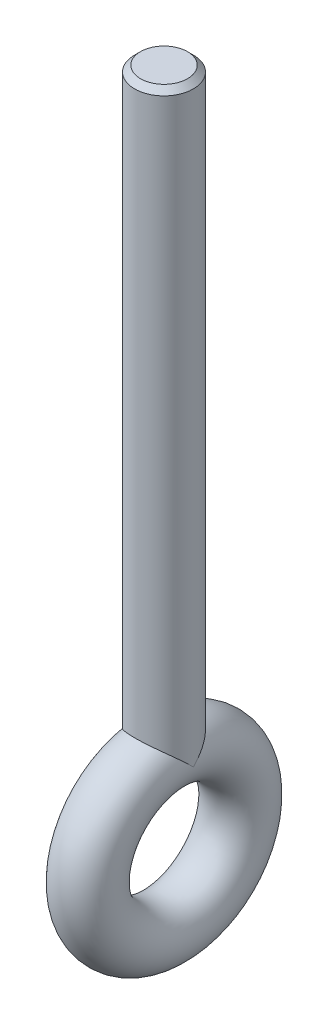
ISO-10303-21;
HEADER;
FILE_DESCRIPTION(('STEP AP214'),'2;1');
FILE_NAME('part.step','',(''),(''),'','','');
FILE_SCHEMA(('AUTOMOTIVE_DESIGN { 1 0 10303 214 1 1 1 1 }'));
ENDSEC;
DATA;
#1=APPLICATION_CONTEXT('core data for automotive mechanical design processes');
#2=APPLICATION_PROTOCOL_DEFINITION('international standard','automotive_design',2000,#1);
#3=PRODUCT_CONTEXT('',#1,'mechanical');
#4=PRODUCT('Part','Part','',(#3));
#5=PRODUCT_RELATED_PRODUCT_CATEGORY('part','',(#4));
#6=PRODUCT_DEFINITION_FORMATION('','',#4);
#7=PRODUCT_DEFINITION_CONTEXT('part definition',#1,'design');
#8=PRODUCT_DEFINITION('design','',#6,#7);
#9=PRODUCT_DEFINITION_SHAPE('','',#8);
#10=(LENGTH_UNIT() NAMED_UNIT(*) SI_UNIT(.MILLI.,.METRE.));
#11=(NAMED_UNIT(*) PLANE_ANGLE_UNIT() SI_UNIT($,.RADIAN.));
#12=(NAMED_UNIT(*) SI_UNIT($,.STERADIAN.) SOLID_ANGLE_UNIT());
#13=UNCERTAINTY_MEASURE_WITH_UNIT(LENGTH_MEASURE(1.E-05),#10,'distance_accuracy_value','');
#14=(GEOMETRIC_REPRESENTATION_CONTEXT(3) GLOBAL_UNCERTAINTY_ASSIGNED_CONTEXT((#13)) GLOBAL_UNIT_ASSIGNED_CONTEXT((#10,
#11,#12)) REPRESENTATION_CONTEXT('',''));
#15=CARTESIAN_POINT('',(0.,0.,0.));
#16=DIRECTION('',(0.,0.,1.));
#17=DIRECTION('',(1.,0.,0.));
#18=AXIS2_PLACEMENT_3D('',#15,#16,#17);
#19=CARTESIAN_POINT('',(0.,-57.,0.));
#20=DIRECTION('',(1.,0.,0.));
#21=DIRECTION('',(0.,0.,1.));
#22=AXIS2_PLACEMENT_3D('',#19,#20,#21);
#23=TOROIDAL_SURFACE('',#22,6.5,2.5);
#24=CARTESIAN_POINT('',(2.5,-50.5,0.));
#25=CARTESIAN_POINT('',(2.4999998519753,-50.4651649450499,0.0348344505927025));
#26=CARTESIAN_POINT('',(2.49927189941043,-50.4304676053622,0.0698082826245213));
#27=CARTESIAN_POINT('',(2.49633216551129,-50.3615765351389,0.139792227453705));
#28=CARTESIAN_POINT('',(2.49412892246899,-50.3273810572834,0.174800980537367));
#29=CARTESIAN_POINT('',(2.48822941530881,-50.2595312191127,0.244796587317843));
#30=CARTESIAN_POINT('',(2.48454243864865,-50.2258748225426,0.279782245642688));
#31=CARTESIAN_POINT('',(2.47566870387325,-50.1591399280342,0.349669598496877));
#32=CARTESIAN_POINT('',(2.47049199876416,-50.1260590825694,0.38457032471366));
#33=CARTESIAN_POINT('',(2.45863483508742,-50.0605110677205,0.454223498115318));
#34=CARTESIAN_POINT('',(2.45196520328561,-50.0280412191219,0.48897526297605));
#35=CARTESIAN_POINT('',(2.43712097010707,-49.9637498764985,0.558263726688542));
#36=CARTESIAN_POINT('',(2.42895797074275,-49.9319253523633,0.592800095229456));
#37=CARTESIAN_POINT('',(2.41112871125689,-49.8689584869557,0.661589292403951));
#38=CARTESIAN_POINT('',(2.40147482070587,-49.837812744329,0.695842208097111));
#39=CARTESIAN_POINT('',(2.38066814398586,-49.7762352340584,0.763993019045374));
#40=CARTESIAN_POINT('',(2.3695284804141,-49.7457996840722,0.797891499132743));
#41=CARTESIAN_POINT('',(2.34503626255162,-49.6838497018394,0.867312180624524));
#42=CARTESIAN_POINT('',(2.33159898290379,-49.6523610258926,0.902827554412133));
#43=CARTESIAN_POINT('',(2.30302708267719,-49.590198054588,0.973385329518649));
#44=CARTESIAN_POINT('',(2.28790563583952,-49.5595194797625,1.00842928926445));
#45=CARTESIAN_POINT('',(2.25597165670608,-49.4990190219382,1.07795984691652));
#46=CARTESIAN_POINT('',(2.23917299705823,-49.4691923704029,1.11244865831707));
#47=CARTESIAN_POINT('',(2.20389555666032,-49.4104387224069,1.18078394377793));
#48=CARTESIAN_POINT('',(2.18543126933451,-49.3815064425272,1.21463334819587));
#49=CARTESIAN_POINT('',(2.14683788839919,-49.3245835551725,1.28160347350608));
#50=CARTESIAN_POINT('',(2.12672381551575,-49.2965871411921,1.3147279046903));
#51=CARTESIAN_POINT('',(2.08485076598944,-49.2415774283213,1.38016096068789));
#52=CARTESIAN_POINT('',(2.06310722314869,-49.21455779598,1.41247412647262));
#53=CARTESIAN_POINT('',(2.01799983536828,-49.1615425293011,1.47619745561844));
#54=CARTESIAN_POINT('',(1.99465170286396,-49.1355400396073,1.50761302420076));
#55=CARTESIAN_POINT('',(1.94636440869489,-49.0845989296952,1.56945289650165));
#56=CARTESIAN_POINT('',(1.92144108489697,-49.059652952365,1.5998834968128));
#57=CARTESIAN_POINT('',(1.86827481321106,-49.0091920995661,1.66172044012806));
#58=CARTESIAN_POINT('',(1.83992261267587,-48.9837314862613,1.69307733209747));
#59=CARTESIAN_POINT('',(1.78149743865257,-48.9341316306051,1.75444632253052));
#60=CARTESIAN_POINT('',(1.75144413676242,-48.9099818533725,1.78446861568752));
#61=CARTESIAN_POINT('',(1.68967262573154,-48.8630476111479,1.84306459913478));
#62=CARTESIAN_POINT('',(1.65797349366026,-48.8402521351544,1.87164955443036));
#63=CARTESIAN_POINT('',(1.59297332072478,-48.7960704029711,1.92727019017921));
#64=CARTESIAN_POINT('',(1.55969045668714,-48.7746727732271,1.95431805353105));
#65=CARTESIAN_POINT('',(1.49159173930169,-48.7333293460177,2.00676708176753));
#66=CARTESIAN_POINT('',(1.45679286813338,-48.7133719724325,2.03218113991001));
#67=CARTESIAN_POINT('',(1.38573871319276,-48.6749512938846,2.08126845902746));
#68=CARTESIAN_POINT('',(1.34949891991776,-48.6564763980875,2.10495505796956));
#69=CARTESIAN_POINT('',(1.2756413013032,-48.6210602148965,2.1505000476379));
#70=CARTESIAN_POINT('',(1.23803725698496,-48.6041075664873,2.17237186936555));
#71=CARTESIAN_POINT('',(1.18056518589665,-48.5798168441105,2.20379997485233));
#72=CARTESIAN_POINT('',(1.16128646235409,-48.5719304635984,2.21401896202217));
#73=CARTESIAN_POINT('',(1.12242007277858,-48.5565545799554,2.23397052295273));
#74=CARTESIAN_POINT('',(1.10283375518018,-48.5490637606325,2.24370470278832));
#75=CARTESIAN_POINT('',(1.06225218019391,-48.5340735063834,2.26321219369764));
#76=CARTESIAN_POINT('',(1.04123722038652,-48.5265946016373,2.27296030480898));
#77=CARTESIAN_POINT('',(0.998921100046556,-48.5121017732341,2.29187752025771));
#78=CARTESIAN_POINT('',(0.977621761813773,-48.505085818838,2.3010491436022));
#79=CARTESIAN_POINT('',(0.934752733102131,-48.4915218190078,2.318803311869));
#80=CARTESIAN_POINT('',(0.913184671359649,-48.4849718268857,2.32738830085755));
#81=CARTESIAN_POINT('',(0.869794416154352,-48.4723426722087,2.3439599832655));
#82=CARTESIAN_POINT('',(0.847973657026655,-48.4662616606127,2.35194902176108));
#83=CARTESIAN_POINT('',(0.804094486610989,-48.4545732562204,2.36732011428389));
#84=CARTESIAN_POINT('',(0.782037317347516,-48.4489641263156,2.37470439165566));
#85=CARTESIAN_POINT('',(0.737702078084783,-48.4382221809127,2.38885790757353));
#86=CARTESIAN_POINT('',(0.715425062374308,-48.4330877543173,2.39562922467928));
#87=CARTESIAN_POINT('',(0.670667132288324,-48.4232978117753,2.40854939010882));
#88=CARTESIAN_POINT('',(0.648187091742627,-48.4186408246102,2.4147001496739));
#89=CARTESIAN_POINT('',(0.603040352050533,-48.4098082632042,2.42637241392847));
#90=CARTESIAN_POINT('',(0.58037435624373,-48.4056313710396,2.43189564077238));
#91=CARTESIAN_POINT('',(0.534873168729661,-48.3977614099155,2.44230670748851));
#92=CARTESIAN_POINT('',(0.512038522509422,-48.3940671890994,2.44719605982719));
#93=CARTESIAN_POINT('',(0.466217704527621,-48.387164891372,2.4563339106165));
#94=CARTESIAN_POINT('',(0.443231935613273,-48.3839558405927,2.46058369277738));
#95=CARTESIAN_POINT('',(0.397126734920186,-48.3780261158144,2.46843761078168));
#96=CARTESIAN_POINT('',(0.374007580983801,-48.3753046568067,2.47204278440668));
#97=CARTESIAN_POINT('',(0.327653649856744,-48.3703522621338,2.47860337611999));
#98=CARTESIAN_POINT('',(0.304419045346194,-48.3681207399483,2.48155957112254));
#99=CARTESIAN_POINT('',(0.257852414064226,-48.3641502797345,2.48681878545556));
#100=CARTESIAN_POINT('',(0.234520476588794,-48.362410961886,2.4891223084362));
#101=CARTESIAN_POINT('',(0.187777526619067,-48.3594268872479,2.49307345851044));
#102=CARTESIAN_POINT('',(0.164366543425,-48.3581819639775,2.49472130639426));
#103=CARTESIAN_POINT('',(0.117483978984563,-48.3561885662396,2.49735907293356));
#104=CARTESIAN_POINT('',(0.0940123916718671,-48.3554401435709,2.49834892294169));
#105=CARTESIAN_POINT('',(0.0470272147667755,-48.3544415642529,2.49966941804037));
#106=CARTESIAN_POINT('',(0.0235136092073164,-48.3541916808299,2.49999970165322));
#107=CARTESIAN_POINT('',(-0.0235098489591216,-48.3541918533658,2.50000029829917));
#108=CARTESIAN_POINT('',(-0.0470197015649339,-48.3544418293819,2.49967071686498));
#109=CARTESIAN_POINT('',(-0.0939978817998216,-48.355440363875,2.49835154118101));
#110=CARTESIAN_POINT('',(-0.117466224780002,-48.3561886596246,2.49736229472375));
#111=CARTESIAN_POINT('',(-0.164342816361563,-48.3581816385001,2.49472572127369));
#112=CARTESIAN_POINT('',(-0.187751069802164,-48.3594262803053,2.49307844906139));
#113=CARTESIAN_POINT('',(-0.234489080176357,-48.3624096616642,2.48912840176425));
#114=CARTESIAN_POINT('',(-0.257818805967819,-48.364148578154,2.48682539194382));
#115=CARTESIAN_POINT('',(-0.30438153550278,-48.3681181481963,2.48156714905982));
#116=CARTESIAN_POINT('',(-0.327614447495364,-48.3703491919895,2.47861139839199));
#117=CARTESIAN_POINT('',(-0.373965514514914,-48.3753005831084,2.47205162673673));
#118=CARTESIAN_POINT('',(-0.397083493801106,-48.378021527327,2.46844681493522));
#119=CARTESIAN_POINT('',(-0.44318686304689,-48.3839502169147,2.46059354047541));
#120=CARTESIAN_POINT('',(-0.466171971510394,-48.387158757606,2.45634402625765));
#121=CARTESIAN_POINT('',(-0.511991981004876,-48.3940600703444,2.44720661953958));
#122=CARTESIAN_POINT('',(-0.534826474959499,-48.3977538265028,2.44231742973583));
#123=CARTESIAN_POINT('',(-0.580327862576109,-48.4056229340486,2.43190658511576));
#124=CARTESIAN_POINT('',(-0.602994205968755,-48.4097994474552,2.42638340448501));
#125=CARTESIAN_POINT('',(-0.648142135385989,-48.4186313672582,2.41471111902706));
#126=CARTESIAN_POINT('',(-0.670623012761787,-48.4232881016506,2.40856027899907));
#127=CARTESIAN_POINT('',(-0.715383098667736,-48.4330776942269,2.39563982885528));
#128=CARTESIAN_POINT('',(-0.737661427561521,-48.4382120336024,2.38886829480477));
#129=CARTESIAN_POINT('',(-0.78199976086257,-48.4489539994488,2.37471421218044));
#130=CARTESIAN_POINT('',(-0.804058704709965,-48.4545632468841,2.36732957275458));
#131=CARTESIAN_POINT('',(-0.847941874751855,-48.4662521191848,2.35195761341411));
#132=CARTESIAN_POINT('',(-0.869764852218532,-48.4723334909104,2.34396805829836));
#133=CARTESIAN_POINT('',(-0.91315997720279,-48.4849636385772,2.32739519709452));
#134=CARTESIAN_POINT('',(-0.934730683293582,-48.4915142732006,2.31880953457037));
#135=CARTESIAN_POINT('',(-0.97760540684382,-48.5050798599203,2.30105384856488));
#136=CARTESIAN_POINT('',(-0.998907788089813,-48.5120967681861,2.29188137008065));
#137=CARTESIAN_POINT('',(-1.04123039982532,-48.5265918717462,2.27296233681008));
#138=CARTESIAN_POINT('',(-1.06224880032186,-48.5340721072722,2.26321325293876));
#139=CARTESIAN_POINT('',(-1.10283063651371,-48.5490627516584,2.24370673878616));
#140=CARTESIAN_POINT('',(-1.12241389668598,-48.5565525026641,2.23397466543943));
#141=CARTESIAN_POINT('',(-1.1612746515852,-48.5719262076325,2.21402702230378));
#142=CARTESIAN_POINT('',(-1.18055078959848,-48.5798114853025,2.2038098360581));
#143=CARTESIAN_POINT('',(-1.23801646657292,-48.6040991940409,2.17238642620199));
#144=CARTESIAN_POINT('',(-1.27561675353706,-48.6210497404058,2.15051741715683));
#145=CARTESIAN_POINT('',(-1.34946871672652,-48.6564620290753,2.10497701667096));
#146=CARTESIAN_POINT('',(-1.3857065390866,-48.6749351902398,2.08129212091992));
#147=CARTESIAN_POINT('',(-1.4567584796803,-48.7133529886383,2.0322071448848));
#148=CARTESIAN_POINT('',(-1.49155703135636,-48.7333092726598,2.00679365979256));
#149=CARTESIAN_POINT('',(-1.55965667132029,-48.7746513632337,1.95434467941507));
#150=CARTESIAN_POINT('',(-1.59294069882121,-48.7960487997119,1.92729623079759));
#151=CARTESIAN_POINT('',(-1.65794459036558,-48.8402312557137,1.87167334312169));
#152=CARTESIAN_POINT('',(-1.68964619754957,-48.863027700712,1.84308666835834));
#153=CARTESIAN_POINT('',(-1.7514237946152,-48.9099651406966,1.78448608545972));
#154=CARTESIAN_POINT('',(-1.78148062610963,-48.9341171956692,1.75446086567499));
#155=CARTESIAN_POINT('',(-1.83991396829932,-48.9837233833929,1.69308523056387));
#156=CARTESIAN_POINT('',(-1.86827072799523,-49.0091881009107,1.66172458421852));
#157=CARTESIAN_POINT('',(-1.92118265464751,-49.0594077859497,1.60018464088354));
#158=CARTESIAN_POINT('',(-1.94586518240383,-49.0840995408994,1.57006301347808));
#159=CARTESIAN_POINT('',(-1.99370587453943,-49.1345154828572,1.5088526871737));
#160=CARTESIAN_POINT('',(-2.01684834105754,-49.1602469555374,1.47775772895334));
#161=CARTESIAN_POINT('',(-2.06157960335658,-49.2127055959384,1.41468528774564));
#162=CARTESIAN_POINT('',(-2.08315282308063,-49.2394395639191,1.38270242756758));
#163=CARTESIAN_POINT('',(-2.12472026884359,-49.2938651477282,1.31793730550736));
#164=CARTESIAN_POINT('',(-2.14469918709659,-49.3215630558581,1.28515051739584));
#165=CARTESIAN_POINT('',(-2.18305698753948,-49.3778779885564,1.2188608854081));
#166=CARTESIAN_POINT('',(-2.20142096081315,-49.4065007931169,1.18535433510314));
#167=CARTESIAN_POINT('',(-2.23653195862065,-49.4646262590303,1.11770783956884));
#168=CARTESIAN_POINT('',(-2.25326458363781,-49.4941341903637,1.08356495768674));
#169=CARTESIAN_POINT('',(-2.28510005353096,-49.5539899566004,1.01472760720248));
#170=CARTESIAN_POINT('',(-2.30018910007056,-49.5843425611052,0.980030912839058));
#171=CARTESIAN_POINT('',(-2.32872860119961,-49.645847099632,0.910166378052756));
#172=CARTESIAN_POINT('',(-2.34216593240788,-49.6770033185559,0.87499695533392));
#173=CARTESIAN_POINT('',(-2.36739704115956,-49.7400735995476,0.804266208954635));
#174=CARTESIAN_POINT('',(-2.37917842643186,-49.7719914795481,0.768703878385601));
#175=CARTESIAN_POINT('',(-2.40109675690938,-49.8365439080848,0.697263165684197));
#176=CARTESIAN_POINT('',(-2.41122208364794,-49.869181836973,0.66138426885212));
#177=CARTESIAN_POINT('',(-2.42671287575791,-49.9240813294386,0.601450439266507));
#178=CARTESIAN_POINT('',(-2.43254689270969,-49.9462154107093,0.577398062448337));
#179=CARTESIAN_POINT('',(-2.4483966192659,-50.0107758881543,0.507567291616706));
#180=CARTESIAN_POINT('',(-2.45742617316521,-50.0534620727118,0.461800305912837));
#181=CARTESIAN_POINT('',(-2.47097438861045,-50.129040283076,0.381516232845518));
#182=CARTESIAN_POINT('',(-2.476055959948,-50.1617961258178,0.346963485794441));
#183=CARTESIAN_POINT('',(-2.48477553267264,-50.227911808147,0.277727005510643));
#184=CARTESIAN_POINT('',(-2.48840182071097,-50.2612743745628,0.243044391747979));
#185=CARTESIAN_POINT('',(-2.49421014917064,-50.3285699278914,0.17361286756205));
#186=CARTESIAN_POINT('',(-2.4963812762741,-50.3625053103682,0.138865373924396));
#187=CARTESIAN_POINT('',(-2.49928115378433,-50.4309128841184,0.0693641937674328));
#188=CARTESIAN_POINT('',(-2.49999977848938,-50.4653871668859,0.034612141404746));
#189=CARTESIAN_POINT('',(-2.5,-50.5,0.));
#190=B_SPLINE_CURVE_WITH_KNOTS('',3,(#24,#25,#26,#27,#28,#29,#30,#31,#32,#33,#34,#35,#36,#37,
#38,#39,#40,#41,#42,#43,#44,#45,#46,#47,#48,#49,#50,#51,#52,#53,#54,#55,#56,#57,#58,#59,#60,#61,
#62,#63,#64,#65,#66,#67,#68,#69,#70,#71,#72,#73,#74,#75,#76,#77,#78,#79,#80,#81,#82,#83,#84,#85,
#86,#87,#88,#89,#90,#91,#92,#93,#94,#95,#96,#97,#98,#99,#100,#101,#102,#103,#104,#105,#106,#107,
#108,#109,#110,#111,#112,#113,#114,#115,#116,#117,#118,#119,#120,#121,#122,#123,#124,#125,#126,
#127,#128,#129,#130,#131,#132,#133,#134,#135,#136,#137,#138,#139,#140,#141,#142,#143,#144,#145,
#146,#147,#148,#149,#150,#151,#152,#153,#154,#155,#156,#157,#158,#159,#160,#161,#162,#163,#164,
#165,#166,#167,#168,#169,#170,#171,#172,#173,#174,#175,#176,#177,#178,#179,#180,#181,#182,#183,
#184,#185,#186,#187,#188,#189),.UNSPECIFIED.,.F.,.F.,(4,2,2,2,2,2,2,2,2,2,2,2,2,2,2,2,2,2,2,2,2,
2,2,2,2,2,2,2,2,2,2,2,2,2,2,2,2,2,2,2,2,2,2,2,2,2,2,2,2,2,2,2,2,2,2,2,2,2,2,2,2,2,2,2,2,2,2,2,2,
2,2,2,2,2,2,2,2,2,2,2,2,2,4),(0.,0.147787301501814,0.294726588086739,0.440760067079174,
0.585830305700144,0.729880742725054,0.872856225587214,1.01470357238207,1.15537215792656,
1.3033257833089,1.45019410716643,1.59593500061896,1.74051166154291,1.88389341085666,
2.02605649624265,2.16698489430558,2.3066711002866,2.45465678545827,2.60118668288796,
2.74628874180017,2.89000589403029,3.03239672270653,3.17353594102112,3.31351464224773,
3.38310943386258,3.45245580254462,3.5254726778498,3.59814442353009,3.67049216572014,
3.74253829101281,3.81430639515864,3.8858212232596,3.95710860151888,4.02819536072194,
4.09910925174348,4.16987885349768,4.24053347387193,4.31110304430404,4.3816180087755,
4.4521092080956,4.52260776043932,4.59314493917321,4.66367083774555,4.73415958260072,
4.80464246050673,4.87515060108785,4.94571485460174,5.0163656724425,5.08713299140352,
5.1580461226633,5.22913364636826,5.3004233125846,5.37194194927794,5.44371537785998,
5.51576833671827,5.5881244130221,5.66080598297853,5.73383416059895,5.80316906227363,
5.87275390458751,6.01271729526773,6.15384735301739,6.29623518658497,6.43995549478094,
6.58506681798465,6.73161201857119,6.87961895134769,7.01790604335938,7.15743626536648,
7.29820228884565,7.44018848529977,7.58337168494229,7.72772194746807,7.87320333465222,
8.01977467628047,8.16739032248163,8.31600087689877,8.41560441468306,8.60523005053827,
8.74885318750063,8.89361019373263,9.03944104090027,9.18628504730161),.UNSPECIFIED.);
#191=CARTESIAN_POINT('',(2.5,-50.5,0.));
#192=VERTEX_POINT('',#191);
#193=CARTESIAN_POINT('',(-2.5,-50.5,0.));
#194=VERTEX_POINT('',#193);
#195=EDGE_CURVE('E11',#192,#194,#190,.T.);
#196=ORIENTED_EDGE('',*,*,#195,.T.);
#197=CARTESIAN_POINT('',(-2.5,-50.5,0.));
#198=CARTESIAN_POINT('',(-2.49999985197531,-50.4651649450577,-0.0348344505847874));
#199=CARTESIAN_POINT('',(-2.49927189941076,-50.4304676053776,-0.0698082826084987));
#200=CARTESIAN_POINT('',(-2.49633216551282,-50.361576535167,-0.139792227423353));
#201=CARTESIAN_POINT('',(-2.49412892247132,-50.3273810573167,-0.174800980500808));
#202=CARTESIAN_POINT('',(-2.488229415313,-50.259531219154,-0.244796587270971));
#203=CARTESIAN_POINT('',(-2.48454243865381,-50.2258748225868,-0.279782245591722));
#204=CARTESIAN_POINT('',(-2.47566870388035,-50.1591399280818,-0.349669598440043));
#205=CARTESIAN_POINT('',(-2.47049199877213,-50.1260590826176,-0.384570324655062));
#206=CARTESIAN_POINT('',(-2.45863483509688,-50.0605110677677,-0.454223498055711));
#207=CARTESIAN_POINT('',(-2.45196520329557,-50.0280412191677,-0.488975262917203));
#208=CARTESIAN_POINT('',(-2.43712097011748,-49.9637498765395,-0.558263726633946));
#209=CARTESIAN_POINT('',(-2.428957970753,-49.931925352401,-0.592800095178353));
#210=CARTESIAN_POINT('',(-2.41112871126601,-49.8689584869849,-0.661589292362652));
#211=CARTESIAN_POINT('',(-2.40147482071389,-49.8378127443532,-0.695842208062119));
#212=CARTESIAN_POINT('',(-2.38066814399067,-49.776235234071,-0.763993019026284));
#213=CARTESIAN_POINT('',(-2.36952848041669,-49.7457996840785,-0.797891499123236));
#214=CARTESIAN_POINT('',(-2.34503626255767,-49.683849701855,-0.867312180609658));
#215=CARTESIAN_POINT('',(-2.3315989829167,-49.6523610259234,-0.902827554382414));
#216=CARTESIAN_POINT('',(-2.30302708270334,-49.5901980546436,-0.973385329462718));
#217=CARTESIAN_POINT('',(-2.28790563587182,-49.5595194798279,-1.00842928919714));
#218=CARTESIAN_POINT('',(-2.25597165674961,-49.4990190220182,-1.07795984683063));
#219=CARTESIAN_POINT('',(-2.23917299710661,-49.4691923704879,-1.11244865822394));
#220=CARTESIAN_POINT('',(-2.20389555671664,-49.4104387224973,-1.18078394367468));
#221=CARTESIAN_POINT('',(-2.18543126939369,-49.3815064426182,-1.21463334808971));
#222=CARTESIAN_POINT('',(-2.1468378884617,-49.3245835552607,-1.28160347339875));
#223=CARTESIAN_POINT('',(-2.12672381557851,-49.296587141277,-1.31472790458464));
#224=CARTESIAN_POINT('',(-2.0848507660497,-49.2415774283962,-1.38016096059049));
#225=CARTESIAN_POINT('',(-2.06310722320596,-49.2145577960483,-1.4124741263817));
#226=CARTESIAN_POINT('',(-2.01799983541596,-49.1615425293533,-1.47619745554539));
#227=CARTESIAN_POINT('',(-1.99465170290478,-49.1355400396501,-1.507613024139));
#228=CARTESIAN_POINT('',(-1.94636440871811,-49.0845989297174,-1.56945289646811));
#229=CARTESIAN_POINT('',(-1.9214410849092,-49.0596529523761,-1.59988349679607));
#230=CARTESIAN_POINT('',(-1.86827481323264,-49.0091920995871,-1.66172044010558));
#231=CARTESIAN_POINT('',(-1.83992261272016,-48.9837314863021,-1.69307733205348));
#232=CARTESIAN_POINT('',(-1.78149743873804,-48.9341316306769,-1.75444632244923));
#233=CARTESIAN_POINT('',(-1.75144413686592,-48.9099818534557,-1.78446861559024));
#234=CARTESIAN_POINT('',(-1.68967262586604,-48.8630476112469,-1.84306459901215));
#235=CARTESIAN_POINT('',(-1.65797349380731,-48.8402521352581,-1.87164955429814));
#236=CARTESIAN_POINT('',(-1.59297332089073,-48.7960704030781,-1.92727019003442));
#237=CARTESIAN_POINT('',(-1.55969045685901,-48.7746727733331,-1.954318053383));
#238=CARTESIAN_POINT('',(-1.49159173947831,-48.7333293461168,-2.00676708161966));
#239=CARTESIAN_POINT('',(-1.45679286830841,-48.7133719725261,-2.03218113976526));
#240=CARTESIAN_POINT('',(-1.38573871335662,-48.6749512939638,-2.08126845889558));
#241=CARTESIAN_POINT('',(-1.34949892007164,-48.656476398158,-2.10495505784709));
#242=CARTESIAN_POINT('',(-1.27564130142848,-48.6210602149478,-2.1505000475408));
#243=CARTESIAN_POINT('',(-1.2380372570912,-48.6041075665282,-2.17237186928403));
#244=CARTESIAN_POINT('',(-1.18056518597056,-48.5798168441368,-2.203799974797));
#245=CARTESIAN_POINT('',(-1.16128646241491,-48.5719304636193,-2.21401896197685));
#246=CARTESIAN_POINT('',(-1.12242007281085,-48.5565545799657,-2.23397052292917));
#247=CARTESIAN_POINT('',(-1.10283375519695,-48.5490637606377,-2.24370470277645));
#248=CARTESIAN_POINT('',(-1.06225218020635,-48.5340735063891,-2.26321219369568));
#249=CARTESIAN_POINT('',(-1.04123722041062,-48.5265946016481,-2.2729603048059));
#250=CARTESIAN_POINT('',(-0.998921100092614,-48.5121017732536,-2.29187752025246));
#251=CARTESIAN_POINT('',(-0.977621761870115,-48.5050858188612,-2.30104914359586));
#252=CARTESIAN_POINT('',(-0.934752733177727,-48.4915218190373,-2.31880331186089));
#253=CARTESIAN_POINT('',(-0.913184671444191,-48.4849718269178,-2.32738830084871));
#254=CARTESIAN_POINT('',(-0.869794416255367,-48.4723426722449,-2.3439599832555));
#255=CARTESIAN_POINT('',(-0.847973657135175,-48.4662616606505,-2.35194902175062));
#256=CARTESIAN_POINT('',(-0.804094486733041,-48.4545732562604,-2.36732011427277));
#257=CARTESIAN_POINT('',(-0.782037317475574,-48.4489641263563,-2.37470439164431));
#258=CARTESIAN_POINT('',(-0.737702078223315,-48.438222180954,-2.388857907562));
#259=CARTESIAN_POINT('',(-0.715425062517288,-48.4330877543585,-2.39562922466775));
#260=CARTESIAN_POINT('',(-0.670667132438609,-48.4232978118156,-2.40854939009749));
#261=CARTESIAN_POINT('',(-0.64818709189575,-48.4186408246498,-2.41470014966274));
#262=CARTESIAN_POINT('',(-0.603040352207697,-48.4098082632418,-2.42637241391784));
#263=CARTESIAN_POINT('',(-0.580374356402081,-48.4056313710759,-2.43189564076208));
#264=CARTESIAN_POINT('',(-0.53487316888871,-48.397761409949,-2.442306707479));
#265=CARTESIAN_POINT('',(-0.512038522667968,-48.3940671891313,-2.44719605981811));
#266=CARTESIAN_POINT('',(-0.46621770468346,-48.3871648914005,-2.45633391060841));
#267=CARTESIAN_POINT('',(-0.443231935766893,-48.3839558406193,-2.46058369276978));
#268=CARTESIAN_POINT('',(-0.397126735067642,-48.3780261158371,-2.46843761077517));
#269=CARTESIAN_POINT('',(-0.3740075811273,-48.3753046568275,-2.4720427844007));
#270=CARTESIAN_POINT('',(-0.327653649990592,-48.3703522621508,-2.47860337611512));
#271=CARTESIAN_POINT('',(-0.304419045474336,-48.3681207399634,-2.48155957111819));
#272=CARTESIAN_POINT('',(-0.257852414179211,-48.3641502797459,-2.48681878545227));
#273=CARTESIAN_POINT('',(-0.23452047669632,-48.3624109618957,-2.48912230843339));
#274=CARTESIAN_POINT('',(-0.18777752670993,-48.3594268872544,-2.49307345850855));
#275=CARTESIAN_POINT('',(-0.164366543506653,-48.3581819639826,-2.49472130639277));
#276=CARTESIAN_POINT('',(-0.117483979046064,-48.3561885662423,-2.49735907293275));
#277=CARTESIAN_POINT('',(-0.0940123917224201,-48.3554401435726,-2.49834892294114));
#278=CARTESIAN_POINT('',(-0.0470272147937168,-48.3544415642533,-2.49966941804026));
#279=CARTESIAN_POINT('',(-0.0235136092215915,-48.3541916808299,-2.49999970165324));
#280=CARTESIAN_POINT('',(0.0235098489574763,-48.3541918533657,-2.50000029829904));
#281=CARTESIAN_POINT('',(0.0470197015632524,-48.3544418293818,-2.49967071686491));
#282=CARTESIAN_POINT('',(0.0939978817980724,-48.3554403638749,-2.498351541181));
#283=CARTESIAN_POINT('',(0.117466224778221,-48.3561886596245,-2.49736229472374));
#284=CARTESIAN_POINT('',(0.164342816359723,-48.3581816385,-2.49472572127369));
#285=CARTESIAN_POINT('',(0.187751069800296,-48.3594262803051,-2.49307844906139));
#286=CARTESIAN_POINT('',(0.234489080174439,-48.362409661664,-2.48912840176429));
#287=CARTESIAN_POINT('',(0.257818805965878,-48.3641485781538,-2.48682539194388));
#288=CARTESIAN_POINT('',(0.304381535500798,-48.368118148196,-2.4815671490599));
#289=CARTESIAN_POINT('',(0.327614447493362,-48.3703491919893,-2.47861139839207));
#290=CARTESIAN_POINT('',(0.373965514512879,-48.3753005831081,-2.47205162673684));
#291=CARTESIAN_POINT('',(0.397083493799056,-48.3780215273268,-2.46844681493535));
#292=CARTESIAN_POINT('',(0.443186863044816,-48.3839502169144,-2.46059354047558));
#293=CARTESIAN_POINT('',(0.46617197150831,-48.3871587576056,-2.45634402625784));
#294=CARTESIAN_POINT('',(0.511991981002777,-48.394060070344,-2.44720661953981));
#295=CARTESIAN_POINT('',(0.534826474957393,-48.3977538265024,-2.44231742973607));
#296=CARTESIAN_POINT('',(0.580327862573996,-48.4056229340482,-2.43190658511604));
#297=CARTESIAN_POINT('',(0.602994205966641,-48.4097994474547,-2.42638340448531));
#298=CARTESIAN_POINT('',(0.648142135383876,-48.4186313672577,-2.41471111902741));
#299=CARTESIAN_POINT('',(0.670623012759677,-48.4232881016501,-2.40856027899944));
#300=CARTESIAN_POINT('',(0.715383098665634,-48.4330776942263,-2.39563982885568));
#301=CARTESIAN_POINT('',(0.737661427559426,-48.4382120336019,-2.3888682948052));
#302=CARTESIAN_POINT('',(0.781999760860493,-48.4489539994482,-2.3747142121809));
#303=CARTESIAN_POINT('',(0.804058704707899,-48.4545632468835,-2.36732957275506));
#304=CARTESIAN_POINT('',(0.847941874749815,-48.4662521191842,-2.35195761341464));
#305=CARTESIAN_POINT('',(0.869764852216506,-48.4723334909098,-2.34396805829891));
#306=CARTESIAN_POINT('',(0.913159977200797,-48.4849636385765,-2.32739519709513));
#307=CARTESIAN_POINT('',(0.93473068329161,-48.4915142731999,-2.31880953457101));
#308=CARTESIAN_POINT('',(0.977605406841887,-48.5050798599197,-2.30105384856557));
#309=CARTESIAN_POINT('',(0.998907788087899,-48.5120967681854,-2.29188137008135));
#310=CARTESIAN_POINT('',(1.04123039982346,-48.5265918717456,-2.27296233681085));
#311=CARTESIAN_POINT('',(1.06224880032004,-48.5340721072715,-2.26321325293958));
#312=CARTESIAN_POINT('',(1.10283063650492,-48.5490627516551,-2.24370673879031));
#313=CARTESIAN_POINT('',(1.12241389667032,-48.5565525026581,-2.23397466544703));
#314=CARTESIAN_POINT('',(1.16127465155689,-48.5719262076209,-2.21402702231786));
#315=CARTESIAN_POINT('',(1.18055078956438,-48.5798114852881,-2.20380983607518));
#316=CARTESIAN_POINT('',(1.23801646652444,-48.604099194019,-2.17238642622675));
#317=CARTESIAN_POINT('',(1.27561675348016,-48.6210497403788,-2.1505174171863));
#318=CARTESIAN_POINT('',(1.34946871665694,-48.6564620290389,-2.10497701670822));
#319=CARTESIAN_POINT('',(1.38570653901262,-48.6749351901992,-2.08129212096011));
#320=CARTESIAN_POINT('',(1.45675847960137,-48.713352988591,-2.0322071449291));
#321=CARTESIAN_POINT('',(1.49155703127673,-48.73330927261,-2.00679365983791));
#322=CARTESIAN_POINT('',(1.55965667124274,-48.7746513631809,-1.95434467946069));
#323=CARTESIAN_POINT('',(1.59294069874629,-48.7960487996587,-1.92729623084232));
#324=CARTESIAN_POINT('',(1.65794459029902,-48.8402312556625,-1.8716733431628));
#325=CARTESIAN_POINT('',(1.68964619748857,-48.8630277006632,-1.84308666839663));
#326=CARTESIAN_POINT('',(1.7514237945679,-48.9099651406556,-1.78448608549044));
#327=CARTESIAN_POINT('',(1.78148062607031,-48.9341171956337,-1.75446086570087));
#328=CARTESIAN_POINT('',(1.83991396827824,-48.9837233833722,-1.69308523057859));
#329=CARTESIAN_POINT('',(1.86827072798423,-49.0091881008995,-1.66172458422684));
#330=CARTESIAN_POINT('',(1.92118265464477,-49.0594077859479,-1.60018464089095));
#331=CARTESIAN_POINT('',(1.94586518240004,-49.0840995408973,-1.5700630134913));
#332=CARTESIAN_POINT('',(1.9937058745338,-49.1345154828541,-1.50885268719701));
#333=CARTESIAN_POINT('',(2.01684834105108,-49.1602469555337,-1.47775772898091));
#334=CARTESIAN_POINT('',(2.06157960334888,-49.2127055959334,-1.41468528778062));
#335=CARTESIAN_POINT('',(2.08315282307247,-49.2394395639135,-1.3827024276057));
#336=CARTESIAN_POINT('',(2.12472026883483,-49.2938651477213,-1.31793730555055));
#337=CARTESIAN_POINT('',(2.14469918708765,-49.3215630558506,-1.28515051744095));
#338=CARTESIAN_POINT('',(2.18305698753046,-49.3778779885477,-1.21886088545591));
#339=CARTESIAN_POINT('',(2.2014209608042,-49.4065007931077,-1.18535433515172));
#340=CARTESIAN_POINT('',(2.23653195861206,-49.4646262590202,-1.11770783961785));
#341=CARTESIAN_POINT('',(2.25326458362948,-49.4941341903533,-1.08356495773541));
#342=CARTESIAN_POINT('',(2.28510005352335,-49.5539899565895,-1.0147276072494));
#343=CARTESIAN_POINT('',(2.30018910006335,-49.5843425610941,-0.98003091288456));
#344=CARTESIAN_POINT('',(2.32872860119336,-49.6458470996211,-0.910166378094423));
#345=CARTESIAN_POINT('',(2.34216593240215,-49.6770033185451,-0.874996955373158));
#346=CARTESIAN_POINT('',(2.36739704115493,-49.7400735995375,-0.804266208988041));
#347=CARTESIAN_POINT('',(2.37917842642779,-49.7719914795385,-0.768703878415598));
#348=CARTESIAN_POINT('',(2.40109675690646,-49.8365439080768,-0.697263165706539));
#349=CARTESIAN_POINT('',(2.4112220836456,-49.869181836966,-0.661384268870212));
#350=CARTESIAN_POINT('',(2.42671287575641,-49.9240813294333,-0.601450439276816));
#351=CARTESIAN_POINT('',(2.43254689270852,-49.9462154107048,-0.577398062455221));
#352=CARTESIAN_POINT('',(2.44839661926895,-50.0107758881661,-0.507567291599829));
#353=CARTESIAN_POINT('',(2.45742617317129,-50.0534620727399,-0.461800305876146));
#354=CARTESIAN_POINT('',(2.47097438861887,-50.1290402831267,-0.381516232783857));
#355=CARTESIAN_POINT('',(2.47605595995647,-50.1617961258743,-0.346963485727224));
#356=CARTESIAN_POINT('',(2.48477553267989,-50.2279118082091,-0.277727005439548));
#357=CARTESIAN_POINT('',(2.48840182071724,-50.2612743746246,-0.243044391678537));
#358=CARTESIAN_POINT('',(2.49421014917445,-50.3285699279462,-0.173612867502625));
#359=CARTESIAN_POINT('',(2.49638127627672,-50.3625053104162,-0.138865373873298));
#360=CARTESIAN_POINT('',(2.49928115378491,-50.430912884146,-0.0693641937390828));
#361=CARTESIAN_POINT('',(2.49999977848939,-50.4653871668999,-0.0346121413907711));
#362=CARTESIAN_POINT('',(2.5,-50.5,0.));
#363=B_SPLINE_CURVE_WITH_KNOTS('',3,(#197,#198,#199,#200,#201,#202,#203,#204,#205,#206,#207,
#208,#209,#210,#211,#212,#213,#214,#215,#216,#217,#218,#219,#220,#221,#222,#223,#224,#225,#226,
#227,#228,#229,#230,#231,#232,#233,#234,#235,#236,#237,#238,#239,#240,#241,#242,#243,#244,#245,
#246,#247,#248,#249,#250,#251,#252,#253,#254,#255,#256,#257,#258,#259,#260,#261,#262,#263,#264,
#265,#266,#267,#268,#269,#270,#271,#272,#273,#274,#275,#276,#277,#278,#279,#280,#281,#282,#283,
#284,#285,#286,#287,#288,#289,#290,#291,#292,#293,#294,#295,#296,#297,#298,#299,#300,#301,#302,
#303,#304,#305,#306,#307,#308,#309,#310,#311,#312,#313,#314,#315,#316,#317,#318,#319,#320,#321,
#322,#323,#324,#325,#326,#327,#328,#329,#330,#331,#332,#333,#334,#335,#336,#337,#338,#339,#340,
#341,#342,#343,#344,#345,#346,#347,#348,#349,#350,#351,#352,#353,#354,#355,#356,#357,#358,#359,
#360,#361,#362),.UNSPECIFIED.,.F.,.F.,(4,2,2,2,2,2,2,2,2,2,2,2,2,2,2,2,2,2,2,2,2,2,2,2,2,2,2,2,
2,2,2,2,2,2,2,2,2,2,2,2,2,2,2,2,2,2,2,2,2,2,2,2,2,2,2,2,2,2,2,2,2,2,2,2,2,2,2,2,2,2,2,2,2,2,2,2,
2,2,2,2,2,2,4),(0.,0.147787301468488,0.294726588029192,0.440760067006726,0.585830305622341,
0.729880742651655,0.87285622552815,1.01470357234745,1.15537215792661,1.30332578324219,
1.45019410705133,1.59593500047427,1.74051166138777,1.88389341071051,2.02605649612514,
2.16698489423653,2.30667110028589,2.45465678534691,2.60118668269695,2.74628874156098,
2.89000589377468,3.03239672246638,3.17353594082833,3.31351464213403,3.38310943380024,
3.45245580254141,3.52547267781039,3.5981444234591,3.67049216562227,3.74253829089282,
3.81430639502135,3.88582122310989,3.95710860136168,4.0281953605622,4.09910925158621,
4.16987885334791,4.24053347373472,4.31110304418447,4.38161800867865,4.45210920802656,
4.5226077604032,4.59314493917508,4.66367083774731,4.73415958260238,4.80464246050831,
4.87515060108935,4.94571485460318,5.01636567244388,5.08713299140485,5.15804612266459,
5.22913364636953,5.30042331258586,5.37194194927918,5.44371537786122,5.51576833671952,
5.58812441302337,5.66080598297982,5.73383416060028,5.80316906225046,5.87275390454314,
6.01271729519082,6.15384735292105,6.29623518648226,6.43995549468479,6.58506681790779,
6.73161201852615,6.87961895134672,7.01790604334485,7.15743626534108,7.29820228881212,
7.44018848526093,7.58337168490095,7.72772194742709,7.87320333461444,8.01977467624871,
8.1673903224587,8.31600087688742,8.41560441468096,8.60523005061332,8.74885318759968,
8.89361019382726,9.03944104096268,9.18628504730464),.UNSPECIFIED.);
#364=EDGE_CURVE('E28',#194,#192,#363,.T.);
#365=ORIENTED_EDGE('',*,*,#364,.T.);
#366=EDGE_LOOP('',(#196,#365));
#367=FACE_BOUND('',#366,.T.);
#368=ADVANCED_FACE('F16',(#367),#23,.T.);
#369=CARTESIAN_POINT('',(0.,0.,0.));
#370=DIRECTION('',(0.,1.,0.));
#371=DIRECTION('',(-1.,0.,0.));
#372=AXIS2_PLACEMENT_3D('',#369,#370,#371);
#373=PLANE('',#372);
#374=CARTESIAN_POINT('',(0.,0.,0.));
#375=DIRECTION('',(0.,1.,0.));
#376=DIRECTION('',(1.,0.,0.));
#377=AXIS2_PLACEMENT_3D('',#374,#375,#376);
#378=CIRCLE('',#377,2.);
#379=CARTESIAN_POINT('',(2.,0.,0.));
#380=VERTEX_POINT('',#379);
#381=EDGE_CURVE('E41',#380,#380,#378,.T.);
#382=ORIENTED_EDGE('',*,*,#381,.T.);
#383=EDGE_LOOP('',(#382));
#384=FACE_BOUND('',#383,.T.);
#385=ADVANCED_FACE('F63',(#384),#373,.T.);
#386=CARTESIAN_POINT('',(0.,-25.25,0.));
#387=DIRECTION('',(0.,1.,0.));
#388=DIRECTION('',(1.,0.,0.));
#389=AXIS2_PLACEMENT_3D('',#386,#387,#388);
#390=CYLINDRICAL_SURFACE('',#389,2.5);
#391=ORIENTED_EDGE('',*,*,#364,.F.);
#392=ORIENTED_EDGE('',*,*,#195,.F.);
#393=EDGE_LOOP('',(#391,#392));
#394=FACE_BOUND('',#393,.T.);
#395=CARTESIAN_POINT('',(0.,-0.5,0.));
#396=DIRECTION('',(0.,-1.,0.));
#397=DIRECTION('',(1.,0.,0.));
#398=AXIS2_PLACEMENT_3D('',#395,#396,#397);
#399=CIRCLE('',#398,2.5);
#400=CARTESIAN_POINT('',(2.5,-0.5,0.));
#401=VERTEX_POINT('',#400);
#402=EDGE_CURVE('E45',#401,#401,#399,.T.);
#403=ORIENTED_EDGE('',*,*,#402,.T.);
#404=EDGE_LOOP('',(#403));
#405=FACE_BOUND('',#404,.T.);
#406=ADVANCED_FACE('F18',(#394,#405),#390,.T.);
#407=CARTESIAN_POINT('',(0.,-0.25,0.));
#408=DIRECTION('',(0.,-1.,0.));
#409=DIRECTION('',(1.,0.,0.));
#410=AXIS2_PLACEMENT_3D('',#407,#408,#409);
#411=CONICAL_SURFACE('',#410,2.25,0.785398163397448);
#412=ORIENTED_EDGE('',*,*,#381,.F.);
#413=EDGE_LOOP('',(#412));
#414=FACE_BOUND('',#413,.T.);
#415=ORIENTED_EDGE('',*,*,#402,.F.);
#416=EDGE_LOOP('',(#415));
#417=FACE_BOUND('',#416,.T.);
#418=ADVANCED_FACE('F76',(#414,#417),#411,.T.);
#419=CLOSED_SHELL('',(#368,#385,#406,#418));
#420=MANIFOLD_SOLID_BREP('B1',#419);
#421=ADVANCED_BREP_SHAPE_REPRESENTATION('',(#18,#420),#14);
#422=SHAPE_DEFINITION_REPRESENTATION(#9,#421);
ENDSEC;
END-ISO-10303-21;
